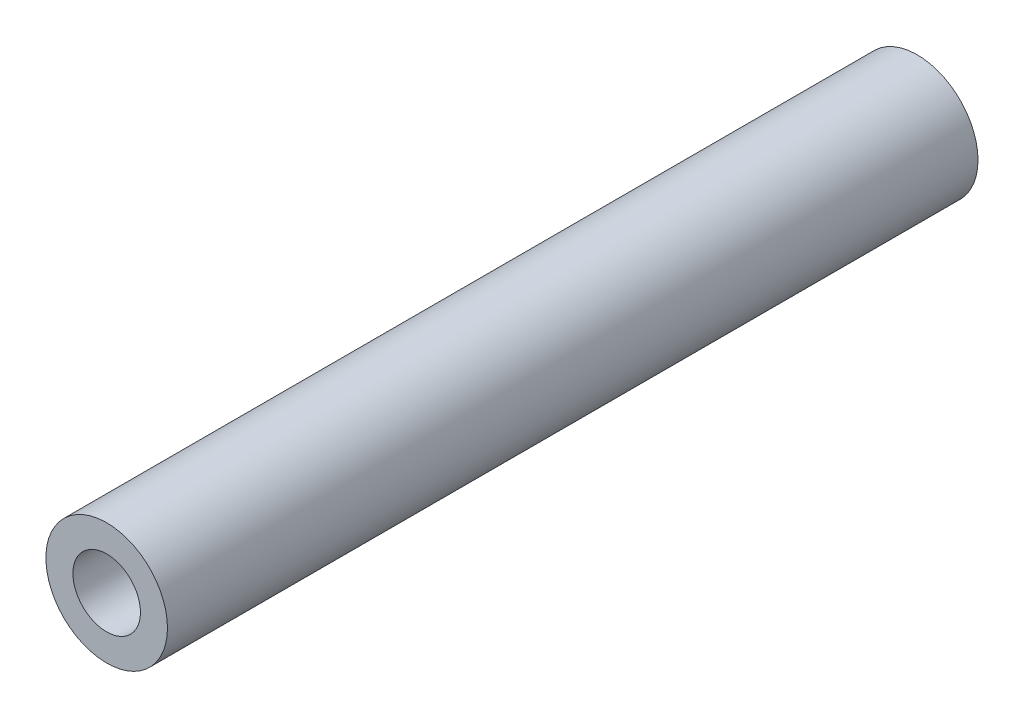
ISO-10303-21;
HEADER;
FILE_DESCRIPTION(('STEP AP214'),'2;1');
FILE_NAME('part.step','',(''),(''),'','','');
FILE_SCHEMA(('AUTOMOTIVE_DESIGN { 1 0 10303 214 1 1 1 1 }'));
ENDSEC;
DATA;
#1=APPLICATION_CONTEXT('core data for automotive mechanical design processes');
#2=APPLICATION_PROTOCOL_DEFINITION('international standard','automotive_design',2000,#1);
#3=PRODUCT_CONTEXT('',#1,'mechanical');
#4=PRODUCT('Part','Part','',(#3));
#5=PRODUCT_RELATED_PRODUCT_CATEGORY('part','',(#4));
#6=PRODUCT_DEFINITION_FORMATION('','',#4);
#7=PRODUCT_DEFINITION_CONTEXT('part definition',#1,'design');
#8=PRODUCT_DEFINITION('design','',#6,#7);
#9=PRODUCT_DEFINITION_SHAPE('','',#8);
#10=(LENGTH_UNIT() NAMED_UNIT(*) SI_UNIT(.MILLI.,.METRE.));
#11=(NAMED_UNIT(*) PLANE_ANGLE_UNIT() SI_UNIT($,.RADIAN.));
#12=(NAMED_UNIT(*) SI_UNIT($,.STERADIAN.) SOLID_ANGLE_UNIT());
#13=UNCERTAINTY_MEASURE_WITH_UNIT(LENGTH_MEASURE(1.E-05),#10,'distance_accuracy_value','');
#14=(GEOMETRIC_REPRESENTATION_CONTEXT(3) GLOBAL_UNCERTAINTY_ASSIGNED_CONTEXT((#13)) GLOBAL_UNIT_ASSIGNED_CONTEXT((#10,
#11,#12)) REPRESENTATION_CONTEXT('',''));
#15=CARTESIAN_POINT('',(0.,0.,0.));
#16=DIRECTION('',(0.,0.,1.));
#17=DIRECTION('',(1.,0.,0.));
#18=AXIS2_PLACEMENT_3D('',#15,#16,#17);
#19=CARTESIAN_POINT('',(0.,0.,38.1));
#20=DIRECTION('',(0.,0.,1.));
#21=DIRECTION('',(1.,0.,0.));
#22=AXIS2_PLACEMENT_3D('',#19,#20,#21);
#23=PLANE('',#22);
#24=CARTESIAN_POINT('',(0.,0.,38.1));
#25=DIRECTION('',(0.,0.,1.));
#26=DIRECTION('',(1.,0.,0.));
#27=AXIS2_PLACEMENT_3D('',#24,#25,#26);
#28=CIRCLE('',#27,2.8575);
#29=CARTESIAN_POINT('',(2.8575,0.,38.1));
#30=VERTEX_POINT('',#29);
#31=EDGE_CURVE('E10',#30,#30,#28,.T.);
#32=ORIENTED_EDGE('',*,*,#31,.T.);
#33=EDGE_LOOP('',(#32));
#34=FACE_BOUND('',#33,.T.);
#35=CARTESIAN_POINT('',(0.,0.,38.1));
#36=DIRECTION('',(0.,0.,1.));
#37=DIRECTION('',(1.,0.,0.));
#38=AXIS2_PLACEMENT_3D('',#35,#36,#37);
#39=CIRCLE('',#38,1.5875);
#40=CARTESIAN_POINT('',(1.5875,0.,38.1));
#41=VERTEX_POINT('',#40);
#42=EDGE_CURVE('E44',#41,#41,#39,.T.);
#43=ORIENTED_EDGE('',*,*,#42,.F.);
#44=EDGE_LOOP('',(#43));
#45=FACE_BOUND('',#44,.T.);
#46=ADVANCED_FACE('F33',(#34,#45),#23,.T.);
#47=CARTESIAN_POINT('',(0.,0.,0.));
#48=DIRECTION('',(0.,0.,1.));
#49=DIRECTION('',(1.,0.,0.));
#50=AXIS2_PLACEMENT_3D('',#47,#48,#49);
#51=PLANE('',#50);
#52=CARTESIAN_POINT('',(0.,0.,0.));
#53=DIRECTION('',(0.,0.,1.));
#54=DIRECTION('',(1.,0.,0.));
#55=AXIS2_PLACEMENT_3D('',#52,#53,#54);
#56=CIRCLE('',#55,2.8575);
#57=CARTESIAN_POINT('',(2.8575,0.,0.));
#58=VERTEX_POINT('',#57);
#59=EDGE_CURVE('E37',#58,#58,#56,.T.);
#60=ORIENTED_EDGE('',*,*,#59,.F.);
#61=EDGE_LOOP('',(#60));
#62=FACE_BOUND('',#61,.T.);
#63=CARTESIAN_POINT('',(0.,0.,0.));
#64=DIRECTION('',(0.,0.,1.));
#65=DIRECTION('',(1.,0.,0.));
#66=AXIS2_PLACEMENT_3D('',#63,#64,#65);
#67=CIRCLE('',#66,1.5875);
#68=CARTESIAN_POINT('',(1.5875,0.,0.));
#69=VERTEX_POINT('',#68);
#70=EDGE_CURVE('E46',#69,#69,#67,.T.);
#71=ORIENTED_EDGE('',*,*,#70,.T.);
#72=EDGE_LOOP('',(#71));
#73=FACE_BOUND('',#72,.T.);
#74=ADVANCED_FACE('F56',(#62,#73),#51,.F.);
#75=CARTESIAN_POINT('',(0.,0.,38.1));
#76=DIRECTION('',(0.,0.,-1.));
#77=DIRECTION('',(-1.,0.,0.));
#78=AXIS2_PLACEMENT_3D('',#75,#76,#77);
#79=CYLINDRICAL_SURFACE('',#78,2.8575);
#80=ORIENTED_EDGE('',*,*,#31,.F.);
#81=EDGE_LOOP('',(#80));
#82=FACE_BOUND('',#81,.T.);
#83=ORIENTED_EDGE('',*,*,#59,.T.);
#84=EDGE_LOOP('',(#83));
#85=FACE_BOUND('',#84,.T.);
#86=ADVANCED_FACE('F35',(#82,#85),#79,.T.);
#87=CARTESIAN_POINT('',(0.,0.,38.1));
#88=DIRECTION('',(0.,0.,-1.));
#89=DIRECTION('',(-1.,0.,0.));
#90=AXIS2_PLACEMENT_3D('',#87,#88,#89);
#91=CYLINDRICAL_SURFACE('',#90,1.5875);
#92=ORIENTED_EDGE('',*,*,#42,.T.);
#93=EDGE_LOOP('',(#92));
#94=FACE_BOUND('',#93,.T.);
#95=ORIENTED_EDGE('',*,*,#70,.F.);
#96=EDGE_LOOP('',(#95));
#97=FACE_BOUND('',#96,.T.);
#98=ADVANCED_FACE('F52',(#94,#97),#91,.F.);
#99=CLOSED_SHELL('',(#46,#74,#86,#98));
#100=MANIFOLD_SOLID_BREP('B2',#99);
#101=ADVANCED_BREP_SHAPE_REPRESENTATION('',(#18,#100),#14);
#102=SHAPE_DEFINITION_REPRESENTATION(#9,#101);
ENDSEC;
END-ISO-10303-21;
